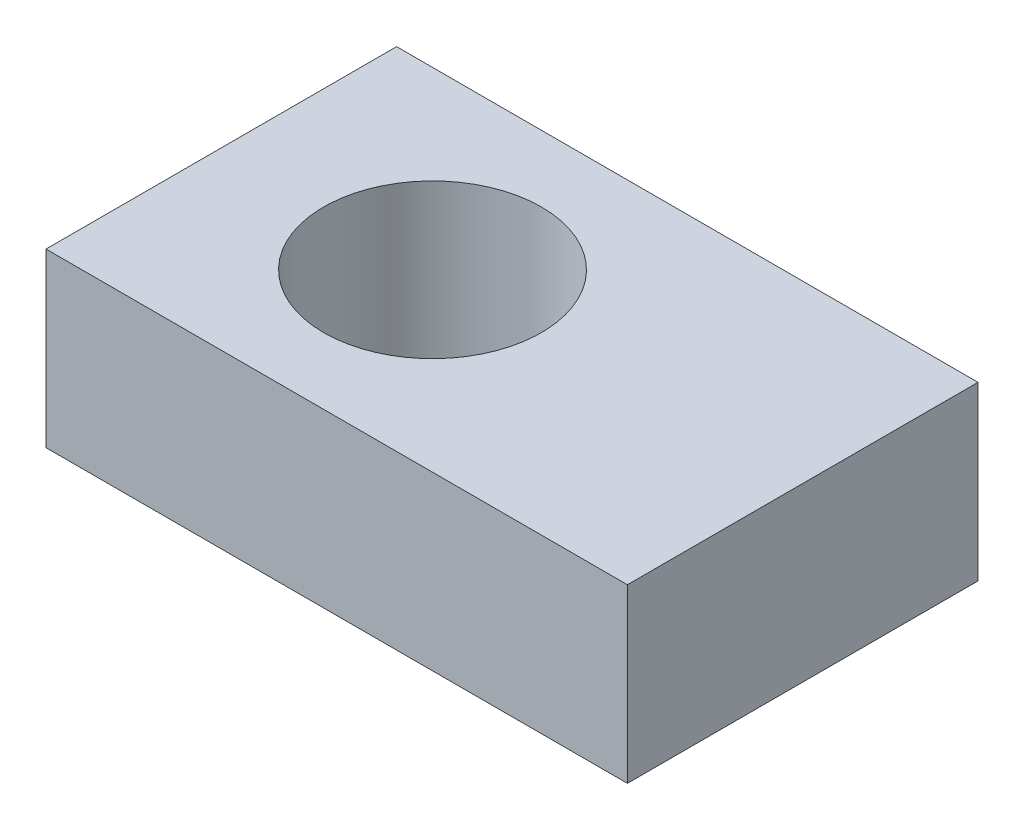
ISO-10303-21;
HEADER;
FILE_DESCRIPTION(('STEP AP214'),'2;1');
FILE_NAME('part.step','',(''),(''),'','','');
FILE_SCHEMA(('AUTOMOTIVE_DESIGN { 1 0 10303 214 1 1 1 1 }'));
ENDSEC;
DATA;
#1=APPLICATION_CONTEXT('core data for automotive mechanical design processes');
#2=APPLICATION_PROTOCOL_DEFINITION('international standard','automotive_design',2000,#1);
#3=PRODUCT_CONTEXT('',#1,'mechanical');
#4=PRODUCT('Part','Part','',(#3));
#5=PRODUCT_RELATED_PRODUCT_CATEGORY('part','',(#4));
#6=PRODUCT_DEFINITION_FORMATION('','',#4);
#7=PRODUCT_DEFINITION_CONTEXT('part definition',#1,'design');
#8=PRODUCT_DEFINITION('design','',#6,#7);
#9=PRODUCT_DEFINITION_SHAPE('','',#8);
#10=(LENGTH_UNIT() NAMED_UNIT(*) SI_UNIT(.MILLI.,.METRE.));
#11=(NAMED_UNIT(*) PLANE_ANGLE_UNIT() SI_UNIT($,.RADIAN.));
#12=(NAMED_UNIT(*) SI_UNIT($,.STERADIAN.) SOLID_ANGLE_UNIT());
#13=UNCERTAINTY_MEASURE_WITH_UNIT(LENGTH_MEASURE(1.E-05),#10,'distance_accuracy_value','');
#14=(GEOMETRIC_REPRESENTATION_CONTEXT(3) GLOBAL_UNCERTAINTY_ASSIGNED_CONTEXT((#13)) GLOBAL_UNIT_ASSIGNED_CONTEXT((#10,
#11,#12)) REPRESENTATION_CONTEXT('',''));
#15=CARTESIAN_POINT('',(0.,0.,0.));
#16=DIRECTION('',(0.,0.,1.));
#17=DIRECTION('',(1.,0.,0.));
#18=AXIS2_PLACEMENT_3D('',#15,#16,#17);
#19=CARTESIAN_POINT('',(34.43,-0.06,4.96));
#20=DIRECTION('',(0.,-1.,0.));
#21=DIRECTION('',(0.,0.,-1.));
#22=AXIS2_PLACEMENT_3D('',#19,#20,#21);
#23=PLANE('',#22);
#24=CARTESIAN_POINT('',(33.7,-0.0599999999999999,4.96));
#25=DIRECTION('',(0.,-1.,0.));
#26=DIRECTION('',(0.,0.,-1.));
#27=AXIS2_PLACEMENT_3D('',#24,#25,#26);
#28=CIRCLE('',#27,1.);
#29=CARTESIAN_POINT('',(33.7,-0.0599999999999999,3.96));
#30=VERTEX_POINT('',#29);
#31=EDGE_CURVE('E20',#30,#30,#28,.F.);
#32=ORIENTED_EDGE('',*,*,#31,.T.);
#33=EDGE_LOOP('',(#32));
#34=FACE_BOUND('',#33,.T.);
#35=DIRECTION('',(0.,0.,1.));
#36=VECTOR('',#35,1.);
#37=CARTESIAN_POINT('',(31.76,-0.0599999999999999,6.57));
#38=LINE('',#37,#36);
#39=CARTESIAN_POINT('',(31.76,-0.06,3.35));
#40=VERTEX_POINT('',#39);
#41=CARTESIAN_POINT('',(31.76,-0.06,6.57));
#42=VERTEX_POINT('',#41);
#43=EDGE_CURVE('E69',#40,#42,#38,.T.);
#44=ORIENTED_EDGE('',*,*,#43,.F.);
#45=DIRECTION('',(-1.,0.,0.));
#46=VECTOR('',#45,1.);
#47=CARTESIAN_POINT('',(31.76,-0.0599999999999999,3.35));
#48=LINE('',#47,#46);
#49=CARTESIAN_POINT('',(37.1,-0.06,3.35));
#50=VERTEX_POINT('',#49);
#51=EDGE_CURVE('E54',#50,#40,#48,.T.);
#52=ORIENTED_EDGE('',*,*,#51,.F.);
#53=DIRECTION('',(0.,0.,-1.));
#54=VECTOR('',#53,1.);
#55=CARTESIAN_POINT('',(37.1,-0.0599999999999999,3.35));
#56=LINE('',#55,#54);
#57=CARTESIAN_POINT('',(37.1,-0.06,6.57));
#58=VERTEX_POINT('',#57);
#59=EDGE_CURVE('E59',#58,#50,#56,.T.);
#60=ORIENTED_EDGE('',*,*,#59,.F.);
#61=DIRECTION('',(1.,0.,0.));
#62=VECTOR('',#61,1.);
#63=CARTESIAN_POINT('',(37.1,-0.0599999999999999,6.57));
#64=LINE('',#63,#62);
#65=EDGE_CURVE('E82',#42,#58,#64,.T.);
#66=ORIENTED_EDGE('',*,*,#65,.F.);
#67=EDGE_LOOP('',(#44,#52,#60,#66));
#68=FACE_BOUND('',#67,.T.);
#69=ADVANCED_FACE('F17',(#34,#68),#23,.T.);
#70=CARTESIAN_POINT('',(37.1,1.52,3.35));
#71=DIRECTION('',(1.,0.,0.));
#72=DIRECTION('',(0.,0.,-1.));
#73=AXIS2_PLACEMENT_3D('',#70,#71,#72);
#74=PLANE('',#73);
#75=ORIENTED_EDGE('',*,*,#59,.T.);
#76=DIRECTION('',(0.,1.,0.));
#77=VECTOR('',#76,1.);
#78=CARTESIAN_POINT('',(37.1,1.52,3.35));
#79=LINE('',#78,#77);
#80=CARTESIAN_POINT('',(37.1,1.52,3.35));
#81=VERTEX_POINT('',#80);
#82=EDGE_CURVE('E61',#81,#50,#79,.F.);
#83=ORIENTED_EDGE('',*,*,#82,.F.);
#84=DIRECTION('',(0.,0.,1.));
#85=VECTOR('',#84,1.);
#86=CARTESIAN_POINT('',(37.1,1.52,4.96));
#87=LINE('',#86,#85);
#88=CARTESIAN_POINT('',(37.1,1.52,6.57));
#89=VERTEX_POINT('',#88);
#90=EDGE_CURVE('E85',#89,#81,#87,.F.);
#91=ORIENTED_EDGE('',*,*,#90,.F.);
#92=DIRECTION('',(0.,1.,0.));
#93=VECTOR('',#92,1.);
#94=CARTESIAN_POINT('',(37.1,1.52,6.57));
#95=LINE('',#94,#93);
#96=EDGE_CURVE('E64',#58,#89,#95,.T.);
#97=ORIENTED_EDGE('',*,*,#96,.F.);
#98=EDGE_LOOP('',(#75,#83,#91,#97));
#99=FACE_BOUND('',#98,.T.);
#100=ADVANCED_FACE('F60',(#99),#74,.T.);
#101=CARTESIAN_POINT('',(31.76,1.52,3.35));
#102=DIRECTION('',(0.,0.,-1.));
#103=DIRECTION('',(-1.,0.,0.));
#104=AXIS2_PLACEMENT_3D('',#101,#102,#103);
#105=PLANE('',#104);
#106=ORIENTED_EDGE('',*,*,#51,.T.);
#107=DIRECTION('',(0.,1.,0.));
#108=VECTOR('',#107,1.);
#109=CARTESIAN_POINT('',(31.76,1.52,3.35));
#110=LINE('',#109,#108);
#111=CARTESIAN_POINT('',(31.76,1.52,3.35));
#112=VERTEX_POINT('',#111);
#113=EDGE_CURVE('E71',#112,#40,#110,.F.);
#114=ORIENTED_EDGE('',*,*,#113,.F.);
#115=DIRECTION('',(1.,0.,0.));
#116=VECTOR('',#115,1.);
#117=CARTESIAN_POINT('',(34.43,1.52,3.35));
#118=LINE('',#117,#116);
#119=EDGE_CURVE('E75',#81,#112,#118,.F.);
#120=ORIENTED_EDGE('',*,*,#119,.F.);
#121=ORIENTED_EDGE('',*,*,#82,.T.);
#122=EDGE_LOOP('',(#106,#114,#120,#121));
#123=FACE_BOUND('',#122,.T.);
#124=ADVANCED_FACE('F73',(#123),#105,.T.);
#125=CARTESIAN_POINT('',(31.76,1.52,6.57));
#126=DIRECTION('',(-1.,0.,0.));
#127=DIRECTION('',(0.,0.,1.));
#128=AXIS2_PLACEMENT_3D('',#125,#126,#127);
#129=PLANE('',#128);
#130=ORIENTED_EDGE('',*,*,#43,.T.);
#131=DIRECTION('',(0.,1.,0.));
#132=VECTOR('',#131,1.);
#133=CARTESIAN_POINT('',(31.76,1.52,6.57));
#134=LINE('',#133,#132);
#135=CARTESIAN_POINT('',(31.76,1.52,6.57));
#136=VERTEX_POINT('',#135);
#137=EDGE_CURVE('E34',#136,#42,#134,.F.);
#138=ORIENTED_EDGE('',*,*,#137,.F.);
#139=DIRECTION('',(0.,0.,1.));
#140=VECTOR('',#139,1.);
#141=CARTESIAN_POINT('',(31.76,1.52,4.96));
#142=LINE('',#141,#140);
#143=EDGE_CURVE('E88',#112,#136,#142,.T.);
#144=ORIENTED_EDGE('',*,*,#143,.F.);
#145=ORIENTED_EDGE('',*,*,#113,.T.);
#146=EDGE_LOOP('',(#130,#138,#144,#145));
#147=FACE_BOUND('',#146,.T.);
#148=ADVANCED_FACE('F98',(#147),#129,.T.);
#149=CARTESIAN_POINT('',(37.1,1.52,6.57));
#150=DIRECTION('',(0.,0.,1.));
#151=DIRECTION('',(1.,0.,0.));
#152=AXIS2_PLACEMENT_3D('',#149,#150,#151);
#153=PLANE('',#152);
#154=ORIENTED_EDGE('',*,*,#65,.T.);
#155=ORIENTED_EDGE('',*,*,#96,.T.);
#156=DIRECTION('',(1.,0.,0.));
#157=VECTOR('',#156,1.);
#158=CARTESIAN_POINT('',(34.43,1.52,6.57));
#159=LINE('',#158,#157);
#160=EDGE_CURVE('E26',#136,#89,#159,.T.);
#161=ORIENTED_EDGE('',*,*,#160,.F.);
#162=ORIENTED_EDGE('',*,*,#137,.T.);
#163=EDGE_LOOP('',(#154,#155,#161,#162));
#164=FACE_BOUND('',#163,.T.);
#165=ADVANCED_FACE('F95',(#164),#153,.T.);
#166=CARTESIAN_POINT('',(33.7,1.52,4.96));
#167=DIRECTION('',(0.,-1.,0.));
#168=DIRECTION('',(0.,0.,-1.));
#169=AXIS2_PLACEMENT_3D('',#166,#167,#168);
#170=CYLINDRICAL_SURFACE('',#169,1.);
#171=ORIENTED_EDGE('',*,*,#31,.F.);
#172=EDGE_LOOP('',(#171));
#173=FACE_BOUND('',#172,.T.);
#174=CARTESIAN_POINT('',(33.7,1.52,4.96));
#175=DIRECTION('',(0.,-1.,0.));
#176=DIRECTION('',(0.,0.,-1.));
#177=AXIS2_PLACEMENT_3D('',#174,#175,#176);
#178=CIRCLE('',#177,1.);
#179=CARTESIAN_POINT('',(33.7,1.52,3.96));
#180=VERTEX_POINT('',#179);
#181=EDGE_CURVE('E11',#180,#180,#178,.T.);
#182=ORIENTED_EDGE('',*,*,#181,.F.);
#183=EDGE_LOOP('',(#182));
#184=FACE_BOUND('',#183,.T.);
#185=ADVANCED_FACE('F97',(#173,#184),#170,.F.);
#186=CARTESIAN_POINT('',(34.43,1.52,4.96));
#187=DIRECTION('',(0.,1.,0.));
#188=DIRECTION('',(0.,0.,1.));
#189=AXIS2_PLACEMENT_3D('',#186,#187,#188);
#190=PLANE('',#189);
#191=ORIENTED_EDGE('',*,*,#181,.T.);
#192=EDGE_LOOP('',(#191));
#193=FACE_BOUND('',#192,.T.);
#194=ORIENTED_EDGE('',*,*,#143,.T.);
#195=ORIENTED_EDGE('',*,*,#160,.T.);
#196=ORIENTED_EDGE('',*,*,#90,.T.);
#197=ORIENTED_EDGE('',*,*,#119,.T.);
#198=EDGE_LOOP('',(#194,#195,#196,#197));
#199=FACE_BOUND('',#198,.T.);
#200=ADVANCED_FACE('F93',(#193,#199),#190,.T.);
#201=CLOSED_SHELL('',(#69,#100,#124,#148,#165,#185,#200));
#202=MANIFOLD_SOLID_BREP('B1',#201);
#203=ADVANCED_BREP_SHAPE_REPRESENTATION('',(#18,#202),#14);
#204=SHAPE_DEFINITION_REPRESENTATION(#9,#203);
ENDSEC;
END-ISO-10303-21;
